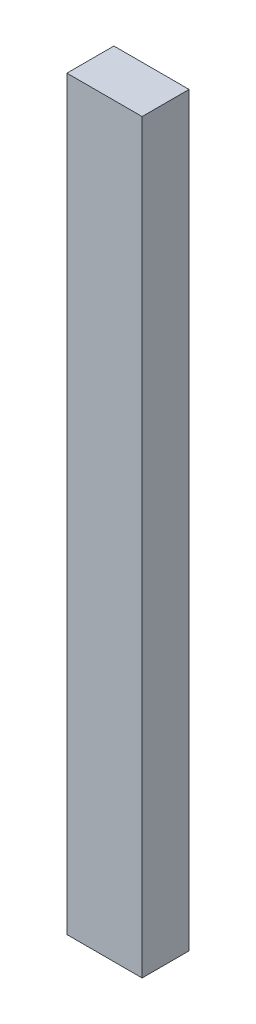
ISO-10303-21;
HEADER;
FILE_DESCRIPTION(('STEP AP214'),'2;1');
FILE_NAME('part.step','',(''),(''),'','','');
FILE_SCHEMA(('AUTOMOTIVE_DESIGN { 1 0 10303 214 1 1 1 1 }'));
ENDSEC;
DATA;
#1=APPLICATION_CONTEXT('core data for automotive mechanical design processes');
#2=APPLICATION_PROTOCOL_DEFINITION('international standard','automotive_design',2000,#1);
#3=PRODUCT_CONTEXT('',#1,'mechanical');
#4=PRODUCT('Part','Part','',(#3));
#5=PRODUCT_RELATED_PRODUCT_CATEGORY('part','',(#4));
#6=PRODUCT_DEFINITION_FORMATION('','',#4);
#7=PRODUCT_DEFINITION_CONTEXT('part definition',#1,'design');
#8=PRODUCT_DEFINITION('design','',#6,#7);
#9=PRODUCT_DEFINITION_SHAPE('','',#8);
#10=(LENGTH_UNIT() NAMED_UNIT(*) SI_UNIT(.MILLI.,.METRE.));
#11=(NAMED_UNIT(*) PLANE_ANGLE_UNIT() SI_UNIT($,.RADIAN.));
#12=(NAMED_UNIT(*) SI_UNIT($,.STERADIAN.) SOLID_ANGLE_UNIT());
#13=UNCERTAINTY_MEASURE_WITH_UNIT(LENGTH_MEASURE(1.E-05),#10,'distance_accuracy_value','');
#14=(GEOMETRIC_REPRESENTATION_CONTEXT(3) GLOBAL_UNCERTAINTY_ASSIGNED_CONTEXT((#13)) GLOBAL_UNIT_ASSIGNED_CONTEXT((#10,
#11,#12)) REPRESENTATION_CONTEXT('',''));
#15=CARTESIAN_POINT('',(0.,0.,0.));
#16=DIRECTION('',(0.,0.,1.));
#17=DIRECTION('',(1.,0.,0.));
#18=AXIS2_PLACEMENT_3D('',#15,#16,#17);
#19=CARTESIAN_POINT('',(0.,0.,15.875));
#20=DIRECTION('',(-1.,0.,0.));
#21=DIRECTION('',(0.,0.,1.));
#22=AXIS2_PLACEMENT_3D('',#19,#20,#21);
#23=PLANE('',#22);
#24=DIRECTION('',(0.,1.,0.));
#25=VECTOR('',#24,1.);
#26=CARTESIAN_POINT('',(0.,0.,0.));
#27=LINE('',#26,#25);
#28=CARTESIAN_POINT('',(0.,0.,0.));
#29=VERTEX_POINT('',#28);
#30=CARTESIAN_POINT('',(0.,252.,0.));
#31=VERTEX_POINT('',#30);
#32=EDGE_CURVE('E96',#29,#31,#27,.T.);
#33=ORIENTED_EDGE('',*,*,#32,.T.);
#34=DIRECTION('',(0.,0.,-1.));
#35=VECTOR('',#34,1.);
#36=CARTESIAN_POINT('',(0.,252.,15.875));
#37=LINE('',#36,#35);
#38=CARTESIAN_POINT('',(0.,252.,15.875));
#39=VERTEX_POINT('',#38);
#40=EDGE_CURVE('E11',#39,#31,#37,.T.);
#41=ORIENTED_EDGE('',*,*,#40,.F.);
#42=DIRECTION('',(0.,1.,0.));
#43=VECTOR('',#42,1.);
#44=CARTESIAN_POINT('',(0.,0.,15.875));
#45=LINE('',#44,#43);
#46=CARTESIAN_POINT('',(0.,0.,15.875));
#47=VERTEX_POINT('',#46);
#48=EDGE_CURVE('E84',#47,#39,#45,.T.);
#49=ORIENTED_EDGE('',*,*,#48,.F.);
#50=DIRECTION('',(0.,0.,-1.));
#51=VECTOR('',#50,1.);
#52=CARTESIAN_POINT('',(0.,0.,15.875));
#53=LINE('',#52,#51);
#54=EDGE_CURVE('E92',#47,#29,#53,.T.);
#55=ORIENTED_EDGE('',*,*,#54,.T.);
#56=EDGE_LOOP('',(#33,#41,#49,#55));
#57=FACE_BOUND('',#56,.T.);
#58=ADVANCED_FACE('F33',(#57),#23,.F.);
#59=CARTESIAN_POINT('',(0.,252.,15.875));
#60=DIRECTION('',(0.,-1.,0.));
#61=DIRECTION('',(0.,0.,-1.));
#62=AXIS2_PLACEMENT_3D('',#59,#60,#61);
#63=PLANE('',#62);
#64=DIRECTION('',(-1.,0.,0.));
#65=VECTOR('',#64,1.);
#66=CARTESIAN_POINT('',(0.,252.,0.));
#67=LINE('',#66,#65);
#68=CARTESIAN_POINT('',(-25.4,252.,0.));
#69=VERTEX_POINT('',#68);
#70=EDGE_CURVE('E88',#31,#69,#67,.T.);
#71=ORIENTED_EDGE('',*,*,#70,.T.);
#72=DIRECTION('',(0.,0.,-1.));
#73=VECTOR('',#72,1.);
#74=CARTESIAN_POINT('',(-25.4,252.,15.875));
#75=LINE('',#74,#73);
#76=CARTESIAN_POINT('',(-25.4,252.,15.875));
#77=VERTEX_POINT('',#76);
#78=EDGE_CURVE('E41',#77,#69,#75,.T.);
#79=ORIENTED_EDGE('',*,*,#78,.F.);
#80=DIRECTION('',(-1.,0.,0.));
#81=VECTOR('',#80,1.);
#82=CARTESIAN_POINT('',(0.,252.,15.875));
#83=LINE('',#82,#81);
#84=EDGE_CURVE('E79',#39,#77,#83,.T.);
#85=ORIENTED_EDGE('',*,*,#84,.F.);
#86=ORIENTED_EDGE('',*,*,#40,.T.);
#87=EDGE_LOOP('',(#71,#79,#85,#86));
#88=FACE_BOUND('',#87,.T.);
#89=ADVANCED_FACE('F87',(#88),#63,.F.);
#90=CARTESIAN_POINT('',(-25.4,0.,15.875));
#91=DIRECTION('',(1.,0.,0.));
#92=DIRECTION('',(0.,0.,-1.));
#93=AXIS2_PLACEMENT_3D('',#90,#91,#92);
#94=PLANE('',#93);
#95=DIRECTION('',(0.,-1.,0.));
#96=VECTOR('',#95,1.);
#97=CARTESIAN_POINT('',(-25.4,0.,0.));
#98=LINE('',#97,#96);
#99=CARTESIAN_POINT('',(-25.4,0.,0.));
#100=VERTEX_POINT('',#99);
#101=EDGE_CURVE('E66',#69,#100,#98,.T.);
#102=ORIENTED_EDGE('',*,*,#101,.T.);
#103=DIRECTION('',(0.,0.,-1.));
#104=VECTOR('',#103,1.);
#105=CARTESIAN_POINT('',(-25.4,0.,15.875));
#106=LINE('',#105,#104);
#107=CARTESIAN_POINT('',(-25.4,0.,15.875));
#108=VERTEX_POINT('',#107);
#109=EDGE_CURVE('E89',#108,#100,#106,.T.);
#110=ORIENTED_EDGE('',*,*,#109,.F.);
#111=DIRECTION('',(0.,-1.,0.));
#112=VECTOR('',#111,1.);
#113=CARTESIAN_POINT('',(-25.4,0.,15.875));
#114=LINE('',#113,#112);
#115=EDGE_CURVE('E82',#77,#108,#114,.T.);
#116=ORIENTED_EDGE('',*,*,#115,.F.);
#117=ORIENTED_EDGE('',*,*,#78,.T.);
#118=EDGE_LOOP('',(#102,#110,#116,#117));
#119=FACE_BOUND('',#118,.T.);
#120=ADVANCED_FACE('F90',(#119),#94,.F.);
#121=CARTESIAN_POINT('',(0.,0.,15.875));
#122=DIRECTION('',(0.,1.,0.));
#123=DIRECTION('',(-1.,0.,0.));
#124=AXIS2_PLACEMENT_3D('',#121,#122,#123);
#125=PLANE('',#124);
#126=DIRECTION('',(1.,0.,0.));
#127=VECTOR('',#126,1.);
#128=CARTESIAN_POINT('',(0.,0.,0.));
#129=LINE('',#128,#127);
#130=EDGE_CURVE('E72',#100,#29,#129,.T.);
#131=ORIENTED_EDGE('',*,*,#130,.T.);
#132=ORIENTED_EDGE('',*,*,#54,.F.);
#133=DIRECTION('',(1.,0.,0.));
#134=VECTOR('',#133,1.);
#135=CARTESIAN_POINT('',(0.,0.,15.875));
#136=LINE('',#135,#134);
#137=EDGE_CURVE('E49',#108,#47,#136,.T.);
#138=ORIENTED_EDGE('',*,*,#137,.F.);
#139=ORIENTED_EDGE('',*,*,#109,.T.);
#140=EDGE_LOOP('',(#131,#132,#138,#139));
#141=FACE_BOUND('',#140,.T.);
#142=ADVANCED_FACE('F103',(#141),#125,.F.);
#143=CARTESIAN_POINT('',(0.,0.,15.875));
#144=DIRECTION('',(0.,0.,1.));
#145=DIRECTION('',(1.,0.,0.));
#146=AXIS2_PLACEMENT_3D('',#143,#144,#145);
#147=PLANE('',#146);
#148=ORIENTED_EDGE('',*,*,#48,.T.);
#149=ORIENTED_EDGE('',*,*,#84,.T.);
#150=ORIENTED_EDGE('',*,*,#115,.T.);
#151=ORIENTED_EDGE('',*,*,#137,.T.);
#152=EDGE_LOOP('',(#148,#149,#150,#151));
#153=FACE_BOUND('',#152,.T.);
#154=ADVANCED_FACE('F80',(#153),#147,.T.);
#155=CARTESIAN_POINT('',(0.,0.,0.));
#156=DIRECTION('',(0.,0.,1.));
#157=DIRECTION('',(1.,0.,0.));
#158=AXIS2_PLACEMENT_3D('',#155,#156,#157);
#159=PLANE('',#158);
#160=ORIENTED_EDGE('',*,*,#32,.F.);
#161=ORIENTED_EDGE('',*,*,#130,.F.);
#162=ORIENTED_EDGE('',*,*,#101,.F.);
#163=ORIENTED_EDGE('',*,*,#70,.F.);
#164=EDGE_LOOP('',(#160,#161,#162,#163));
#165=FACE_BOUND('',#164,.T.);
#166=ADVANCED_FACE('F106',(#165),#159,.F.);
#167=CLOSED_SHELL('',(#58,#89,#120,#142,#154,#166));
#168=MANIFOLD_SOLID_BREP('B2',#167);
#169=ADVANCED_BREP_SHAPE_REPRESENTATION('',(#18,#168),#14);
#170=SHAPE_DEFINITION_REPRESENTATION(#9,#169);
ENDSEC;
END-ISO-10303-21;
